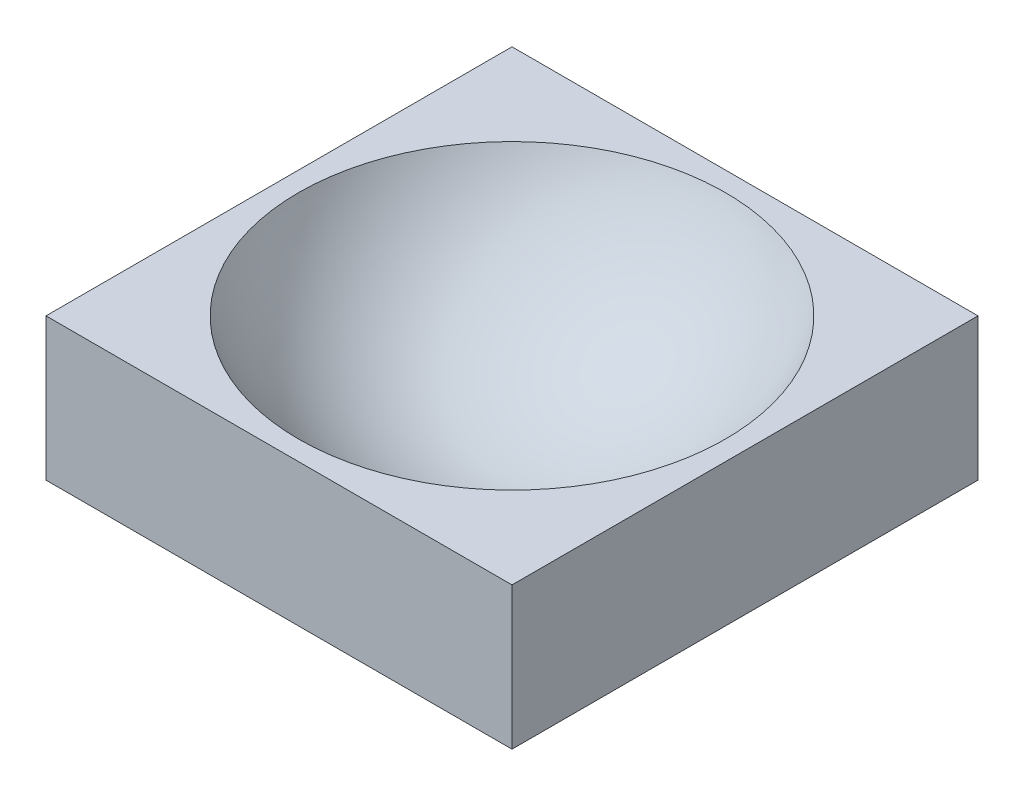
ISO-10303-21;
HEADER;
FILE_DESCRIPTION(('STEP AP214'),'2;1');
FILE_NAME('part.step','',(''),(''),'','','');
FILE_SCHEMA(('AUTOMOTIVE_DESIGN { 1 0 10303 214 1 1 1 1 }'));
ENDSEC;
DATA;
#1=APPLICATION_CONTEXT('core data for automotive mechanical design processes');
#2=APPLICATION_PROTOCOL_DEFINITION('international standard','automotive_design',2000,#1);
#3=PRODUCT_CONTEXT('',#1,'mechanical');
#4=PRODUCT('Part','Part','',(#3));
#5=PRODUCT_RELATED_PRODUCT_CATEGORY('part','',(#4));
#6=PRODUCT_DEFINITION_FORMATION('','',#4);
#7=PRODUCT_DEFINITION_CONTEXT('part definition',#1,'design');
#8=PRODUCT_DEFINITION('design','',#6,#7);
#9=PRODUCT_DEFINITION_SHAPE('','',#8);
#10=(LENGTH_UNIT() NAMED_UNIT(*) SI_UNIT(.MILLI.,.METRE.));
#11=(NAMED_UNIT(*) PLANE_ANGLE_UNIT() SI_UNIT($,.RADIAN.));
#12=(NAMED_UNIT(*) SI_UNIT($,.STERADIAN.) SOLID_ANGLE_UNIT());
#13=UNCERTAINTY_MEASURE_WITH_UNIT(LENGTH_MEASURE(1.E-05),#10,'distance_accuracy_value','');
#14=(GEOMETRIC_REPRESENTATION_CONTEXT(3) GLOBAL_UNCERTAINTY_ASSIGNED_CONTEXT((#13)) GLOBAL_UNIT_ASSIGNED_CONTEXT((#10,
#11,#12)) REPRESENTATION_CONTEXT('',''));
#15=CARTESIAN_POINT('',(0.,0.,0.));
#16=DIRECTION('',(0.,0.,1.));
#17=DIRECTION('',(1.,0.,0.));
#18=AXIS2_PLACEMENT_3D('',#15,#16,#17);
#19=CARTESIAN_POINT('',(119.15,72.7666666666667,-119.15));
#20=DIRECTION('',(-1.,0.,0.));
#21=DIRECTION('',(0.,0.,1.));
#22=AXIS2_PLACEMENT_3D('',#19,#20,#21);
#23=PLANE('',#22);
#24=DIRECTION('',(0.,0.,-1.));
#25=VECTOR('',#24,1.);
#26=CARTESIAN_POINT('',(119.15,0.,-119.15));
#27=LINE('',#26,#25);
#28=CARTESIAN_POINT('',(119.15,0.,119.15));
#29=VERTEX_POINT('',#28);
#30=CARTESIAN_POINT('',(119.15,0.,-119.15));
#31=VERTEX_POINT('',#30);
#32=EDGE_CURVE('E100',#29,#31,#27,.T.);
#33=ORIENTED_EDGE('',*,*,#32,.T.);
#34=DIRECTION('',(0.,-1.,0.));
#35=VECTOR('',#34,1.);
#36=CARTESIAN_POINT('',(119.15,72.7666666666667,-119.15));
#37=LINE('',#36,#35);
#38=CARTESIAN_POINT('',(119.15,72.7666666666667,-119.15));
#39=VERTEX_POINT('',#38);
#40=EDGE_CURVE('E11',#39,#31,#37,.T.);
#41=ORIENTED_EDGE('',*,*,#40,.F.);
#42=DIRECTION('',(0.,0.,-1.));
#43=VECTOR('',#42,1.);
#44=CARTESIAN_POINT('',(119.15,72.7666666666667,-119.15));
#45=LINE('',#44,#43);
#46=CARTESIAN_POINT('',(119.15,72.7666666666667,119.15));
#47=VERTEX_POINT('',#46);
#48=EDGE_CURVE('E88',#47,#39,#45,.T.);
#49=ORIENTED_EDGE('',*,*,#48,.F.);
#50=DIRECTION('',(0.,-1.,0.));
#51=VECTOR('',#50,1.);
#52=CARTESIAN_POINT('',(119.15,72.7666666666667,119.15));
#53=LINE('',#52,#51);
#54=EDGE_CURVE('E96',#47,#29,#53,.T.);
#55=ORIENTED_EDGE('',*,*,#54,.T.);
#56=EDGE_LOOP('',(#33,#41,#49,#55));
#57=FACE_BOUND('',#56,.T.);
#58=ADVANCED_FACE('F37',(#57),#23,.F.);
#59=CARTESIAN_POINT('',(119.15,72.7666666666667,-119.15));
#60=DIRECTION('',(0.,0.,1.));
#61=DIRECTION('',(1.,0.,0.));
#62=AXIS2_PLACEMENT_3D('',#59,#60,#61);
#63=PLANE('',#62);
#64=DIRECTION('',(-1.,0.,0.));
#65=VECTOR('',#64,1.);
#66=CARTESIAN_POINT('',(119.15,0.,-119.15));
#67=LINE('',#66,#65);
#68=CARTESIAN_POINT('',(-119.15,0.,-119.15));
#69=VERTEX_POINT('',#68);
#70=EDGE_CURVE('E92',#31,#69,#67,.T.);
#71=ORIENTED_EDGE('',*,*,#70,.T.);
#72=DIRECTION('',(0.,-1.,0.));
#73=VECTOR('',#72,1.);
#74=CARTESIAN_POINT('',(-119.15,72.7666666666667,-119.15));
#75=LINE('',#74,#73);
#76=CARTESIAN_POINT('',(-119.15,72.7666666666667,-119.15));
#77=VERTEX_POINT('',#76);
#78=EDGE_CURVE('E45',#77,#69,#75,.T.);
#79=ORIENTED_EDGE('',*,*,#78,.F.);
#80=DIRECTION('',(-1.,0.,0.));
#81=VECTOR('',#80,1.);
#82=CARTESIAN_POINT('',(119.15,72.7666666666667,-119.15));
#83=LINE('',#82,#81);
#84=EDGE_CURVE('E83',#39,#77,#83,.T.);
#85=ORIENTED_EDGE('',*,*,#84,.F.);
#86=ORIENTED_EDGE('',*,*,#40,.T.);
#87=EDGE_LOOP('',(#71,#79,#85,#86));
#88=FACE_BOUND('',#87,.T.);
#89=ADVANCED_FACE('F91',(#88),#63,.F.);
#90=CARTESIAN_POINT('',(-119.15,72.7666666666667,-119.15));
#91=DIRECTION('',(1.,0.,0.));
#92=DIRECTION('',(0.,0.,-1.));
#93=AXIS2_PLACEMENT_3D('',#90,#91,#92);
#94=PLANE('',#93);
#95=DIRECTION('',(0.,0.,1.));
#96=VECTOR('',#95,1.);
#97=CARTESIAN_POINT('',(-119.15,0.,-119.15));
#98=LINE('',#97,#96);
#99=CARTESIAN_POINT('',(-119.15,0.,119.15));
#100=VERTEX_POINT('',#99);
#101=EDGE_CURVE('E70',#69,#100,#98,.T.);
#102=ORIENTED_EDGE('',*,*,#101,.T.);
#103=DIRECTION('',(0.,-1.,0.));
#104=VECTOR('',#103,1.);
#105=CARTESIAN_POINT('',(-119.15,72.7666666666667,119.15));
#106=LINE('',#105,#104);
#107=CARTESIAN_POINT('',(-119.15,72.7666666666667,119.15));
#108=VERTEX_POINT('',#107);
#109=EDGE_CURVE('E93',#108,#100,#106,.T.);
#110=ORIENTED_EDGE('',*,*,#109,.F.);
#111=DIRECTION('',(0.,0.,1.));
#112=VECTOR('',#111,1.);
#113=CARTESIAN_POINT('',(-119.15,72.7666666666667,-119.15));
#114=LINE('',#113,#112);
#115=EDGE_CURVE('E86',#77,#108,#114,.T.);
#116=ORIENTED_EDGE('',*,*,#115,.F.);
#117=ORIENTED_EDGE('',*,*,#78,.T.);
#118=EDGE_LOOP('',(#102,#110,#116,#117));
#119=FACE_BOUND('',#118,.T.);
#120=ADVANCED_FACE('F94',(#119),#94,.F.);
#121=CARTESIAN_POINT('',(119.15,72.7666666666667,119.15));
#122=DIRECTION('',(0.,0.,-1.));
#123=DIRECTION('',(-1.,0.,0.));
#124=AXIS2_PLACEMENT_3D('',#121,#122,#123);
#125=PLANE('',#124);
#126=DIRECTION('',(1.,0.,0.));
#127=VECTOR('',#126,1.);
#128=CARTESIAN_POINT('',(119.15,0.,119.15));
#129=LINE('',#128,#127);
#130=EDGE_CURVE('E76',#100,#29,#129,.T.);
#131=ORIENTED_EDGE('',*,*,#130,.T.);
#132=ORIENTED_EDGE('',*,*,#54,.F.);
#133=DIRECTION('',(1.,0.,0.));
#134=VECTOR('',#133,1.);
#135=CARTESIAN_POINT('',(119.15,72.7666666666667,119.15));
#136=LINE('',#135,#134);
#137=EDGE_CURVE('E53',#108,#47,#136,.T.);
#138=ORIENTED_EDGE('',*,*,#137,.F.);
#139=ORIENTED_EDGE('',*,*,#109,.T.);
#140=EDGE_LOOP('',(#131,#132,#138,#139));
#141=FACE_BOUND('',#140,.T.);
#142=ADVANCED_FACE('F108',(#141),#125,.F.);
#143=CARTESIAN_POINT('',(0.,72.7666666666667,0.));
#144=DIRECTION('',(0.,-1.,0.));
#145=DIRECTION('',(0.,0.,-1.));
#146=AXIS2_PLACEMENT_3D('',#143,#144,#145);
#147=PLANE('',#146);
#148=CARTESIAN_POINT('',(0.,72.7666666666667,0.));
#149=DIRECTION('',(0.,1.,0.));
#150=DIRECTION('',(0.,0.,1.));
#151=AXIS2_PLACEMENT_3D('',#148,#149,#150);
#152=CIRCLE('',#151,109.15);
#153=CARTESIAN_POINT('',(0.,72.7666666666667,109.15));
#154=VERTEX_POINT('',#153);
#155=EDGE_CURVE('E103',#154,#154,#152,.T.);
#156=ORIENTED_EDGE('',*,*,#155,.F.);
#157=EDGE_LOOP('',(#156));
#158=FACE_BOUND('',#157,.T.);
#159=ORIENTED_EDGE('',*,*,#48,.T.);
#160=ORIENTED_EDGE('',*,*,#84,.T.);
#161=ORIENTED_EDGE('',*,*,#115,.T.);
#162=ORIENTED_EDGE('',*,*,#137,.T.);
#163=EDGE_LOOP('',(#159,#160,#161,#162));
#164=FACE_BOUND('',#163,.T.);
#165=ADVANCED_FACE('F84',(#158,#164),#147,.F.);
#166=CARTESIAN_POINT('',(0.,0.,0.));
#167=DIRECTION('',(0.,-1.,0.));
#168=DIRECTION('',(0.,0.,-1.));
#169=AXIS2_PLACEMENT_3D('',#166,#167,#168);
#170=PLANE('',#169);
#171=ORIENTED_EDGE('',*,*,#32,.F.);
#172=ORIENTED_EDGE('',*,*,#130,.F.);
#173=ORIENTED_EDGE('',*,*,#101,.F.);
#174=ORIENTED_EDGE('',*,*,#70,.F.);
#175=EDGE_LOOP('',(#171,#172,#173,#174));
#176=FACE_BOUND('',#175,.T.);
#177=ADVANCED_FACE('F111',(#176),#170,.T.);
#178=CARTESIAN_POINT('',(0.,119.15,0.));
#179=DIRECTION('',(0.,1.,0.));
#180=DIRECTION('',(-1.,0.,0.));
#181=AXIS2_PLACEMENT_3D('',#178,#179,#180);
#182=SPHERICAL_SURFACE('',#181,118.596526555844);
#183=ORIENTED_EDGE('',*,*,#155,.T.);
#184=EDGE_LOOP('',(#183));
#185=FACE_BOUND('',#184,.T.);
#186=ADVANCED_FACE('F117',(#185),#182,.F.);
#187=CLOSED_SHELL('',(#58,#89,#120,#142,#165,#177,#186));
#188=MANIFOLD_SOLID_BREP('B2',#187);
#189=ADVANCED_BREP_SHAPE_REPRESENTATION('',(#18,#188),#14);
#190=SHAPE_DEFINITION_REPRESENTATION(#9,#189);
ENDSEC;
END-ISO-10303-21;
